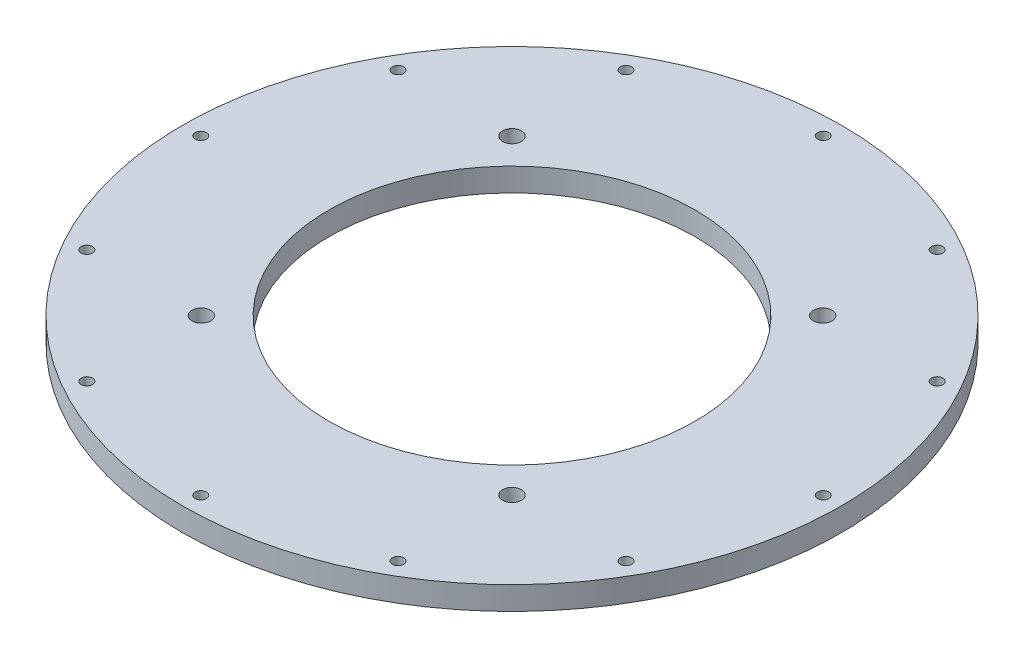
ISO-10303-21;
HEADER;
FILE_DESCRIPTION(('STEP AP214'),'2;1');
FILE_NAME('part.step','',(''),(''),'','','');
FILE_SCHEMA(('AUTOMOTIVE_DESIGN { 1 0 10303 214 1 1 1 1 }'));
ENDSEC;
DATA;
#1=APPLICATION_CONTEXT('core data for automotive mechanical design processes');
#2=APPLICATION_PROTOCOL_DEFINITION('international standard','automotive_design',2000,#1);
#3=PRODUCT_CONTEXT('',#1,'mechanical');
#4=PRODUCT('Part','Part','',(#3));
#5=PRODUCT_RELATED_PRODUCT_CATEGORY('part','',(#4));
#6=PRODUCT_DEFINITION_FORMATION('','',#4);
#7=PRODUCT_DEFINITION_CONTEXT('part definition',#1,'design');
#8=PRODUCT_DEFINITION('design','',#6,#7);
#9=PRODUCT_DEFINITION_SHAPE('','',#8);
#10=(LENGTH_UNIT() NAMED_UNIT(*) SI_UNIT(.MILLI.,.METRE.));
#11=(NAMED_UNIT(*) PLANE_ANGLE_UNIT() SI_UNIT($,.RADIAN.));
#12=(NAMED_UNIT(*) SI_UNIT($,.STERADIAN.) SOLID_ANGLE_UNIT());
#13=UNCERTAINTY_MEASURE_WITH_UNIT(LENGTH_MEASURE(1.E-05),#10,'distance_accuracy_value','');
#14=(GEOMETRIC_REPRESENTATION_CONTEXT(3) GLOBAL_UNCERTAINTY_ASSIGNED_CONTEXT((#13)) GLOBAL_UNIT_ASSIGNED_CONTEXT((#10,
#11,#12)) REPRESENTATION_CONTEXT('',''));
#15=CARTESIAN_POINT('',(0.,0.,0.));
#16=DIRECTION('',(0.,0.,1.));
#17=DIRECTION('',(1.,0.,0.));
#18=AXIS2_PLACEMENT_3D('',#15,#16,#17);
#19=CARTESIAN_POINT('',(78.55,0.,0.));
#20=DIRECTION('',(0.,0.,1.));
#21=DIRECTION('',(1.,0.,0.));
#22=AXIS2_PLACEMENT_3D('',#19,#20,#21);
#23=ELLIPSE('',#22,3.25,2.165);
#24=CARTESIAN_POINT('',(0.,0.,0.));
#25=DIRECTION('',(0.,-1.,0.));
#26=AXIS1_PLACEMENT('',#24,#25);
#27=SURFACE_OF_REVOLUTION('',#23,#26);
#28=CARTESIAN_POINT('',(0.,0.,0.));
#29=DIRECTION('',(0.,-1.,0.));
#30=DIRECTION('',(0.,0.,-1.));
#31=AXIS2_PLACEMENT_3D('',#28,#29,#30);
#32=CIRCLE('',#31,75.3);
#33=CARTESIAN_POINT('',(0.,0.,-75.3));
#34=VERTEX_POINT('',#33);
#35=EDGE_CURVE('E61',#34,#34,#32,.T.);
#36=ORIENTED_EDGE('',*,*,#35,.F.);
#37=EDGE_LOOP('',(#36));
#38=FACE_BOUND('',#37,.T.);
#39=CARTESIAN_POINT('',(0.,0.,0.));
#40=DIRECTION('',(0.,-1.,0.));
#41=DIRECTION('',(0.,0.,-1.));
#42=AXIS2_PLACEMENT_3D('',#39,#40,#41);
#43=CIRCLE('',#42,81.8);
#44=CARTESIAN_POINT('',(0.,0.,-81.8));
#45=VERTEX_POINT('',#44);
#46=EDGE_CURVE('E10',#45,#45,#43,.T.);
#47=ORIENTED_EDGE('',*,*,#46,.T.);
#48=EDGE_LOOP('',(#47));
#49=FACE_BOUND('',#48,.T.);
#50=ADVANCED_FACE('F38',(#38,#49),#27,.T.);
#51=CARTESIAN_POINT('',(0.,0.,0.));
#52=DIRECTION('',(0.,-1.,0.));
#53=DIRECTION('',(0.,0.,-1.));
#54=AXIS2_PLACEMENT_3D('',#51,#52,#53);
#55=PLANE('',#54);
#56=CARTESIAN_POINT('',(0.,0.,85.));
#57=DIRECTION('',(0.,-1.,0.));
#58=DIRECTION('',(0.,0.,-1.));
#59=AXIS2_PLACEMENT_3D('',#56,#57,#58);
#60=CIRCLE('',#59,1.55);
#61=CARTESIAN_POINT('',(0.,0.,83.45));
#62=VERTEX_POINT('',#61);
#63=EDGE_CURVE('E89',#62,#62,#60,.T.);
#64=ORIENTED_EDGE('',*,*,#63,.F.);
#65=EDGE_LOOP('',(#64));
#66=FACE_BOUND('',#65,.T.);
#67=CARTESIAN_POINT('',(-85.,0.,8.90327741404999E-13));
#68=DIRECTION('',(0.,-1.,0.));
#69=DIRECTION('',(0.,0.,-1.));
#70=AXIS2_PLACEMENT_3D('',#67,#68,#69);
#71=CIRCLE('',#70,1.55);
#72=CARTESIAN_POINT('',(-85.,0.,-1.54999999999911));
#73=VERTEX_POINT('',#72);
#74=EDGE_CURVE('E99',#73,#73,#71,.T.);
#75=ORIENTED_EDGE('',*,*,#74,.F.);
#76=EDGE_LOOP('',(#75));
#77=FACE_BOUND('',#76,.T.);
#78=CARTESIAN_POINT('',(-73.6121593216768,0.,42.5000000000009));
#79=DIRECTION('',(0.,-1.,0.));
#80=DIRECTION('',(0.,0.,-1.));
#81=AXIS2_PLACEMENT_3D('',#78,#79,#80);
#82=CIRCLE('',#81,1.54999999999999);
#83=CARTESIAN_POINT('',(-73.6121593216768,0.,40.9500000000009));
#84=VERTEX_POINT('',#83);
#85=EDGE_CURVE('E130',#84,#84,#82,.T.);
#86=ORIENTED_EDGE('',*,*,#85,.F.);
#87=EDGE_LOOP('',(#86));
#88=FACE_BOUND('',#87,.T.);
#89=CARTESIAN_POINT('',(-42.4999999999991,0.,73.6121593216778));
#90=DIRECTION('',(0.,-1.,0.));
#91=DIRECTION('',(0.,0.,-1.));
#92=AXIS2_PLACEMENT_3D('',#89,#90,#91);
#93=CIRCLE('',#92,1.54999999999999);
#94=CARTESIAN_POINT('',(-42.4999999999991,0.,72.0621593216778));
#95=VERTEX_POINT('',#94);
#96=EDGE_CURVE('E124',#95,#95,#93,.T.);
#97=ORIENTED_EDGE('',*,*,#96,.F.);
#98=EDGE_LOOP('',(#97));
#99=FACE_BOUND('',#98,.T.);
#100=CARTESIAN_POINT('',(42.5000000000001,0.,73.6121593216772));
#101=DIRECTION('',(0.,-1.,0.));
#102=DIRECTION('',(0.,0.,-1.));
#103=AXIS2_PLACEMENT_3D('',#100,#101,#102);
#104=CIRCLE('',#103,1.55);
#105=CARTESIAN_POINT('',(42.5000000000001,0.,72.0621593216772));
#106=VERTEX_POINT('',#105);
#107=EDGE_CURVE('E86',#106,#106,#104,.T.);
#108=ORIENTED_EDGE('',*,*,#107,.F.);
#109=EDGE_LOOP('',(#108));
#110=FACE_BOUND('',#109,.T.);
#111=CARTESIAN_POINT('',(73.6121593216774,0.,42.4999999999998));
#112=DIRECTION('',(0.,-1.,0.));
#113=DIRECTION('',(0.,0.,-1.));
#114=AXIS2_PLACEMENT_3D('',#111,#112,#113);
#115=CIRCLE('',#114,1.55);
#116=CARTESIAN_POINT('',(73.6121593216774,0.,40.9499999999998));
#117=VERTEX_POINT('',#116);
#118=EDGE_CURVE('E80',#117,#117,#115,.T.);
#119=ORIENTED_EDGE('',*,*,#118,.F.);
#120=EDGE_LOOP('',(#119));
#121=FACE_BOUND('',#120,.T.);
#122=CARTESIAN_POINT('',(85.,0.,-2.96775913801666E-13));
#123=DIRECTION('',(0.,-1.,0.));
#124=DIRECTION('',(0.,0.,-1.));
#125=AXIS2_PLACEMENT_3D('',#122,#123,#124);
#126=CIRCLE('',#125,1.55);
#127=CARTESIAN_POINT('',(85.,0.,-1.5500000000003));
#128=VERTEX_POINT('',#127);
#129=EDGE_CURVE('E74',#128,#128,#126,.T.);
#130=ORIENTED_EDGE('',*,*,#129,.F.);
#131=EDGE_LOOP('',(#130));
#132=FACE_BOUND('',#131,.T.);
#133=CARTESIAN_POINT('',(73.6121593216771,0.,-42.5000000000003));
#134=DIRECTION('',(0.,-1.,0.));
#135=DIRECTION('',(0.,0.,-1.));
#136=AXIS2_PLACEMENT_3D('',#133,#134,#135);
#137=CIRCLE('',#136,1.55000000000001);
#138=CARTESIAN_POINT('',(73.6121593216771,0.,-44.0500000000004));
#139=VERTEX_POINT('',#138);
#140=EDGE_CURVE('E66',#139,#139,#137,.T.);
#141=ORIENTED_EDGE('',*,*,#140,.F.);
#142=EDGE_LOOP('',(#141));
#143=FACE_BOUND('',#142,.T.);
#144=CARTESIAN_POINT('',(42.4999999999996,0.,-73.6121593216776));
#145=DIRECTION('',(0.,-1.,0.));
#146=DIRECTION('',(0.,0.,-1.));
#147=AXIS2_PLACEMENT_3D('',#144,#145,#146);
#148=CIRCLE('',#147,1.55);
#149=CARTESIAN_POINT('',(42.4999999999996,0.,-75.1621593216775));
#150=VERTEX_POINT('',#149);
#151=EDGE_CURVE('E73',#150,#150,#148,.T.);
#152=ORIENTED_EDGE('',*,*,#151,.F.);
#153=EDGE_LOOP('',(#152));
#154=FACE_BOUND('',#153,.T.);
#155=CARTESIAN_POINT('',(-5.93551827603333E-13,0.,-85.));
#156=DIRECTION('',(0.,-1.,0.));
#157=DIRECTION('',(0.,0.,-1.));
#158=AXIS2_PLACEMENT_3D('',#155,#156,#157);
#159=CIRCLE('',#158,1.55);
#160=CARTESIAN_POINT('',(-5.93551827603333E-13,0.,-86.55));
#161=VERTEX_POINT('',#160);
#162=EDGE_CURVE('E106',#161,#161,#159,.T.);
#163=ORIENTED_EDGE('',*,*,#162,.F.);
#164=EDGE_LOOP('',(#163));
#165=FACE_BOUND('',#164,.T.);
#166=CARTESIAN_POINT('',(-42.5000000000006,0.,-73.612159321677));
#167=DIRECTION('',(0.,-1.,0.));
#168=DIRECTION('',(0.,0.,-1.));
#169=AXIS2_PLACEMENT_3D('',#166,#167,#168);
#170=CIRCLE('',#169,1.55);
#171=CARTESIAN_POINT('',(-42.5000000000006,0.,-75.162159321677));
#172=VERTEX_POINT('',#171);
#173=EDGE_CURVE('E100',#172,#172,#170,.T.);
#174=ORIENTED_EDGE('',*,*,#173,.F.);
#175=EDGE_LOOP('',(#174));
#176=FACE_BOUND('',#175,.T.);
#177=CARTESIAN_POINT('',(-73.6121593216777,0.,-42.4999999999993));
#178=DIRECTION('',(0.,-1.,0.));
#179=DIRECTION('',(0.,0.,-1.));
#180=AXIS2_PLACEMENT_3D('',#177,#178,#179);
#181=CIRCLE('',#180,1.54999999999999);
#182=CARTESIAN_POINT('',(-73.6121593216777,0.,-44.0499999999993));
#183=VERTEX_POINT('',#182);
#184=EDGE_CURVE('E92',#183,#183,#181,.T.);
#185=ORIENTED_EDGE('',*,*,#184,.F.);
#186=EDGE_LOOP('',(#185));
#187=FACE_BOUND('',#186,.T.);
#188=CARTESIAN_POINT('',(0.,0.,0.));
#189=DIRECTION('',(0.,-1.,0.));
#190=DIRECTION('',(0.,0.,-1.));
#191=AXIS2_PLACEMENT_3D('',#188,#189,#190);
#192=CIRCLE('',#191,90.);
#193=CARTESIAN_POINT('',(0.,0.,-90.));
#194=VERTEX_POINT('',#193);
#195=EDGE_CURVE('E45',#194,#194,#192,.T.);
#196=ORIENTED_EDGE('',*,*,#195,.T.);
#197=EDGE_LOOP('',(#196));
#198=FACE_BOUND('',#197,.T.);
#199=ORIENTED_EDGE('',*,*,#46,.F.);
#200=EDGE_LOOP('',(#199));
#201=FACE_BOUND('',#200,.T.);
#202=ADVANCED_FACE('F164',(#66,#77,#88,#99,#110,#121,#132,#143,#154,#165,#176,#187,#198,#201),
#55,.T.);
#203=CARTESIAN_POINT('',(0.,0.,0.));
#204=DIRECTION('',(0.,-1.,0.));
#205=DIRECTION('',(0.,0.,-1.));
#206=AXIS2_PLACEMENT_3D('',#203,#204,#205);
#207=CYLINDRICAL_SURFACE('',#206,90.);
#208=ORIENTED_EDGE('',*,*,#195,.F.);
#209=EDGE_LOOP('',(#208));
#210=FACE_BOUND('',#209,.T.);
#211=CARTESIAN_POINT('',(0.,6.35,0.));
#212=DIRECTION('',(0.,-1.,0.));
#213=DIRECTION('',(0.,0.,-1.));
#214=AXIS2_PLACEMENT_3D('',#211,#212,#213);
#215=CIRCLE('',#214,90.);
#216=CARTESIAN_POINT('',(0.,6.35,-90.));
#217=VERTEX_POINT('',#216);
#218=EDGE_CURVE('E49',#217,#217,#215,.T.);
#219=ORIENTED_EDGE('',*,*,#218,.T.);
#220=EDGE_LOOP('',(#219));
#221=FACE_BOUND('',#220,.T.);
#222=ADVANCED_FACE('F167',(#210,#221),#207,.T.);
#223=CARTESIAN_POINT('',(0.,6.35,0.));
#224=DIRECTION('',(0.,-1.,0.));
#225=DIRECTION('',(0.,0.,-1.));
#226=AXIS2_PLACEMENT_3D('',#223,#224,#225);
#227=PLANE('',#226);
#228=CARTESIAN_POINT('',(0.,6.35,85.));
#229=DIRECTION('',(0.,-1.,0.));
#230=DIRECTION('',(0.,0.,-1.));
#231=AXIS2_PLACEMENT_3D('',#228,#229,#230);
#232=CIRCLE('',#231,1.55);
#233=CARTESIAN_POINT('',(0.,6.35,83.45));
#234=VERTEX_POINT('',#233);
#235=EDGE_CURVE('E63',#234,#234,#232,.F.);
#236=ORIENTED_EDGE('',*,*,#235,.F.);
#237=EDGE_LOOP('',(#236));
#238=FACE_BOUND('',#237,.T.);
#239=CARTESIAN_POINT('',(-85.,6.35,8.90327741404999E-13));
#240=DIRECTION('',(0.,-1.,0.));
#241=DIRECTION('',(0.,0.,-1.));
#242=AXIS2_PLACEMENT_3D('',#239,#240,#241);
#243=CIRCLE('',#242,1.55);
#244=CARTESIAN_POINT('',(-85.,6.35,-1.54999999999911));
#245=VERTEX_POINT('',#244);
#246=EDGE_CURVE('E133',#245,#245,#243,.F.);
#247=ORIENTED_EDGE('',*,*,#246,.F.);
#248=EDGE_LOOP('',(#247));
#249=FACE_BOUND('',#248,.T.);
#250=CARTESIAN_POINT('',(-73.6121593216768,6.35,42.5000000000009));
#251=DIRECTION('',(0.,-1.,0.));
#252=DIRECTION('',(0.,0.,-1.));
#253=AXIS2_PLACEMENT_3D('',#250,#251,#252);
#254=CIRCLE('',#253,1.54999999999999);
#255=CARTESIAN_POINT('',(-73.6121593216768,6.35,40.9500000000009));
#256=VERTEX_POINT('',#255);
#257=EDGE_CURVE('E127',#256,#256,#254,.F.);
#258=ORIENTED_EDGE('',*,*,#257,.F.);
#259=EDGE_LOOP('',(#258));
#260=FACE_BOUND('',#259,.T.);
#261=CARTESIAN_POINT('',(-42.4999999999991,6.35,73.6121593216778));
#262=DIRECTION('',(0.,-1.,0.));
#263=DIRECTION('',(0.,0.,-1.));
#264=AXIS2_PLACEMENT_3D('',#261,#262,#263);
#265=CIRCLE('',#264,1.54999999999999);
#266=CARTESIAN_POINT('',(-42.4999999999991,6.35,72.0621593216778));
#267=VERTEX_POINT('',#266);
#268=EDGE_CURVE('E119',#267,#267,#265,.F.);
#269=ORIENTED_EDGE('',*,*,#268,.F.);
#270=EDGE_LOOP('',(#269));
#271=FACE_BOUND('',#270,.T.);
#272=CARTESIAN_POINT('',(-42.4264068711928,6.35,42.4264068711929));
#273=DIRECTION('',(0.,-1.,0.));
#274=DIRECTION('',(0.,0.,-1.));
#275=AXIS2_PLACEMENT_3D('',#272,#273,#274);
#276=CIRCLE('',#275,2.55);
#277=CARTESIAN_POINT('',(-42.4264068711928,6.35,39.8764068711929));
#278=VERTEX_POINT('',#277);
#279=EDGE_CURVE('E120',#278,#278,#276,.F.);
#280=ORIENTED_EDGE('',*,*,#279,.F.);
#281=EDGE_LOOP('',(#280));
#282=FACE_BOUND('',#281,.T.);
#283=CARTESIAN_POINT('',(42.4264068711929,6.35,42.4264068711928));
#284=DIRECTION('',(0.,-1.,0.));
#285=DIRECTION('',(0.,0.,-1.));
#286=AXIS2_PLACEMENT_3D('',#283,#284,#285);
#287=CIRCLE('',#286,2.55000000000018);
#288=CARTESIAN_POINT('',(42.4264068711929,6.35,39.8764068711926));
#289=VERTEX_POINT('',#288);
#290=EDGE_CURVE('E150',#289,#289,#287,.F.);
#291=ORIENTED_EDGE('',*,*,#290,.F.);
#292=EDGE_LOOP('',(#291));
#293=FACE_BOUND('',#292,.T.);
#294=CARTESIAN_POINT('',(42.4264068711928,6.35,-42.4264068711929));
#295=DIRECTION('',(0.,-1.,0.));
#296=DIRECTION('',(0.,0.,-1.));
#297=AXIS2_PLACEMENT_3D('',#294,#295,#296);
#298=CIRCLE('',#297,2.55000000000038);
#299=CARTESIAN_POINT('',(42.4264068711928,6.35,-44.9764068711933));
#300=VERTEX_POINT('',#299);
#301=EDGE_CURVE('E143',#300,#300,#298,.F.);
#302=ORIENTED_EDGE('',*,*,#301,.F.);
#303=EDGE_LOOP('',(#302));
#304=FACE_BOUND('',#303,.T.);
#305=CARTESIAN_POINT('',(-42.4264068711929,6.35,-42.4264068711928));
#306=DIRECTION('',(0.,-1.,0.));
#307=DIRECTION('',(0.,0.,-1.));
#308=AXIS2_PLACEMENT_3D('',#305,#306,#307);
#309=CIRCLE('',#308,2.55000000000056);
#310=CARTESIAN_POINT('',(-42.4264068711929,6.35,-44.9764068711933));
#311=VERTEX_POINT('',#310);
#312=EDGE_CURVE('E144',#311,#311,#309,.F.);
#313=ORIENTED_EDGE('',*,*,#312,.F.);
#314=EDGE_LOOP('',(#313));
#315=FACE_BOUND('',#314,.T.);
#316=CARTESIAN_POINT('',(42.5000000000001,6.35,73.6121593216772));
#317=DIRECTION('',(0.,-1.,0.));
#318=DIRECTION('',(0.,0.,-1.));
#319=AXIS2_PLACEMENT_3D('',#316,#317,#318);
#320=CIRCLE('',#319,1.55);
#321=CARTESIAN_POINT('',(42.5000000000001,6.35,72.0621593216772));
#322=VERTEX_POINT('',#321);
#323=EDGE_CURVE('E83',#322,#322,#320,.F.);
#324=ORIENTED_EDGE('',*,*,#323,.F.);
#325=EDGE_LOOP('',(#324));
#326=FACE_BOUND('',#325,.T.);
#327=CARTESIAN_POINT('',(73.6121593216774,6.35,42.4999999999998));
#328=DIRECTION('',(0.,-1.,0.));
#329=DIRECTION('',(0.,0.,-1.));
#330=AXIS2_PLACEMENT_3D('',#327,#328,#329);
#331=CIRCLE('',#330,1.55);
#332=CARTESIAN_POINT('',(73.6121593216774,6.35,40.9499999999998));
#333=VERTEX_POINT('',#332);
#334=EDGE_CURVE('E77',#333,#333,#331,.F.);
#335=ORIENTED_EDGE('',*,*,#334,.F.);
#336=EDGE_LOOP('',(#335));
#337=FACE_BOUND('',#336,.T.);
#338=CARTESIAN_POINT('',(85.,6.35,-2.96775913801666E-13));
#339=DIRECTION('',(0.,-1.,0.));
#340=DIRECTION('',(0.,0.,-1.));
#341=AXIS2_PLACEMENT_3D('',#338,#339,#340);
#342=CIRCLE('',#341,1.55);
#343=CARTESIAN_POINT('',(85.,6.35,-1.5500000000003));
#344=VERTEX_POINT('',#343);
#345=EDGE_CURVE('E69',#344,#344,#342,.F.);
#346=ORIENTED_EDGE('',*,*,#345,.F.);
#347=EDGE_LOOP('',(#346));
#348=FACE_BOUND('',#347,.T.);
#349=CARTESIAN_POINT('',(73.6121593216771,6.35,-42.5000000000003));
#350=DIRECTION('',(0.,-1.,0.));
#351=DIRECTION('',(0.,0.,-1.));
#352=AXIS2_PLACEMENT_3D('',#349,#350,#351);
#353=CIRCLE('',#352,1.55000000000001);
#354=CARTESIAN_POINT('',(73.6121593216771,6.35,-44.0500000000004));
#355=VERTEX_POINT('',#354);
#356=EDGE_CURVE('E70',#355,#355,#353,.F.);
#357=ORIENTED_EDGE('',*,*,#356,.F.);
#358=EDGE_LOOP('',(#357));
#359=FACE_BOUND('',#358,.T.);
#360=CARTESIAN_POINT('',(42.4999999999996,6.35,-73.6121593216776));
#361=DIRECTION('',(0.,-1.,0.));
#362=DIRECTION('',(0.,0.,-1.));
#363=AXIS2_PLACEMENT_3D('',#360,#361,#362);
#364=CIRCLE('',#363,1.55);
#365=CARTESIAN_POINT('',(42.4999999999996,6.35,-75.1621593216775));
#366=VERTEX_POINT('',#365);
#367=EDGE_CURVE('E109',#366,#366,#364,.F.);
#368=ORIENTED_EDGE('',*,*,#367,.F.);
#369=EDGE_LOOP('',(#368));
#370=FACE_BOUND('',#369,.T.);
#371=CARTESIAN_POINT('',(-5.93551827603333E-13,6.35,-85.));
#372=DIRECTION('',(0.,-1.,0.));
#373=DIRECTION('',(0.,0.,-1.));
#374=AXIS2_PLACEMENT_3D('',#371,#372,#373);
#375=CIRCLE('',#374,1.55);
#376=CARTESIAN_POINT('',(-5.93551827603333E-13,6.35,-86.55));
#377=VERTEX_POINT('',#376);
#378=EDGE_CURVE('E103',#377,#377,#375,.F.);
#379=ORIENTED_EDGE('',*,*,#378,.F.);
#380=EDGE_LOOP('',(#379));
#381=FACE_BOUND('',#380,.T.);
#382=CARTESIAN_POINT('',(-42.5000000000006,6.35,-73.612159321677));
#383=DIRECTION('',(0.,-1.,0.));
#384=DIRECTION('',(0.,0.,-1.));
#385=AXIS2_PLACEMENT_3D('',#382,#383,#384);
#386=CIRCLE('',#385,1.55);
#387=CARTESIAN_POINT('',(-42.5000000000006,6.35,-75.162159321677));
#388=VERTEX_POINT('',#387);
#389=EDGE_CURVE('E95',#388,#388,#386,.F.);
#390=ORIENTED_EDGE('',*,*,#389,.F.);
#391=EDGE_LOOP('',(#390));
#392=FACE_BOUND('',#391,.T.);
#393=CARTESIAN_POINT('',(-73.6121593216777,6.35,-42.4999999999993));
#394=DIRECTION('',(0.,-1.,0.));
#395=DIRECTION('',(0.,0.,-1.));
#396=AXIS2_PLACEMENT_3D('',#393,#394,#395);
#397=CIRCLE('',#396,1.54999999999999);
#398=CARTESIAN_POINT('',(-73.6121593216777,6.35,-44.0499999999993));
#399=VERTEX_POINT('',#398);
#400=EDGE_CURVE('E96',#399,#399,#397,.F.);
#401=ORIENTED_EDGE('',*,*,#400,.F.);
#402=EDGE_LOOP('',(#401));
#403=FACE_BOUND('',#402,.T.);
#404=ORIENTED_EDGE('',*,*,#218,.F.);
#405=EDGE_LOOP('',(#404));
#406=FACE_BOUND('',#405,.T.);
#407=CARTESIAN_POINT('',(0.,6.35,0.));
#408=DIRECTION('',(0.,-1.,0.));
#409=DIRECTION('',(0.,0.,-1.));
#410=AXIS2_PLACEMENT_3D('',#407,#408,#409);
#411=CIRCLE('',#410,50.);
#412=CARTESIAN_POINT('',(0.,6.35,-50.));
#413=VERTEX_POINT('',#412);
#414=EDGE_CURVE('E53',#413,#413,#411,.T.);
#415=ORIENTED_EDGE('',*,*,#414,.T.);
#416=EDGE_LOOP('',(#415));
#417=FACE_BOUND('',#416,.T.);
#418=ADVANCED_FACE('F226',(#238,#249,#260,#271,#282,#293,#304,#315,#326,#337,#348,#359,#370,
#381,#392,#403,#406,#417),#227,.F.);
#419=CARTESIAN_POINT('',(0.,0.,0.));
#420=DIRECTION('',(0.,-1.,0.));
#421=DIRECTION('',(0.,0.,-1.));
#422=AXIS2_PLACEMENT_3D('',#419,#420,#421);
#423=CYLINDRICAL_SURFACE('',#422,50.);
#424=CARTESIAN_POINT('',(0.,0.,0.));
#425=DIRECTION('',(0.,-1.,0.));
#426=DIRECTION('',(0.,0.,-1.));
#427=AXIS2_PLACEMENT_3D('',#424,#425,#426);
#428=CIRCLE('',#427,50.);
#429=CARTESIAN_POINT('',(0.,0.,-50.));
#430=VERTEX_POINT('',#429);
#431=EDGE_CURVE('E58',#430,#430,#428,.T.);
#432=ORIENTED_EDGE('',*,*,#431,.T.);
#433=EDGE_LOOP('',(#432));
#434=FACE_BOUND('',#433,.T.);
#435=ORIENTED_EDGE('',*,*,#414,.F.);
#436=EDGE_LOOP('',(#435));
#437=FACE_BOUND('',#436,.T.);
#438=ADVANCED_FACE('F220',(#434,#437),#423,.F.);
#439=CARTESIAN_POINT('',(-42.4264068711928,0.,42.4264068711929));
#440=DIRECTION('',(0.,-1.,0.));
#441=DIRECTION('',(0.,0.,-1.));
#442=AXIS2_PLACEMENT_3D('',#439,#440,#441);
#443=CIRCLE('',#442,2.55);
#444=CARTESIAN_POINT('',(-42.4264068711928,0.,39.8764068711929));
#445=VERTEX_POINT('',#444);
#446=EDGE_CURVE('E116',#445,#445,#443,.T.);
#447=ORIENTED_EDGE('',*,*,#446,.F.);
#448=EDGE_LOOP('',(#447));
#449=FACE_BOUND('',#448,.T.);
#450=CARTESIAN_POINT('',(42.4264068711929,0.,42.4264068711928));
#451=DIRECTION('',(0.,-1.,0.));
#452=DIRECTION('',(0.,0.,-1.));
#453=AXIS2_PLACEMENT_3D('',#450,#451,#452);
#454=CIRCLE('',#453,2.55000000000018);
#455=CARTESIAN_POINT('',(42.4264068711929,0.,39.8764068711926));
#456=VERTEX_POINT('',#455);
#457=EDGE_CURVE('E123',#456,#456,#454,.T.);
#458=ORIENTED_EDGE('',*,*,#457,.F.);
#459=EDGE_LOOP('',(#458));
#460=FACE_BOUND('',#459,.T.);
#461=CARTESIAN_POINT('',(42.4264068711928,0.,-42.4264068711929));
#462=DIRECTION('',(0.,-1.,0.));
#463=DIRECTION('',(0.,0.,-1.));
#464=AXIS2_PLACEMENT_3D('',#461,#462,#463);
#465=CIRCLE('',#464,2.55000000000038);
#466=CARTESIAN_POINT('',(42.4264068711928,0.,-44.9764068711933));
#467=VERTEX_POINT('',#466);
#468=EDGE_CURVE('E147',#467,#467,#465,.T.);
#469=ORIENTED_EDGE('',*,*,#468,.F.);
#470=EDGE_LOOP('',(#469));
#471=FACE_BOUND('',#470,.T.);
#472=CARTESIAN_POINT('',(-42.4264068711929,0.,-42.4264068711928));
#473=DIRECTION('',(0.,-1.,0.));
#474=DIRECTION('',(0.,0.,-1.));
#475=AXIS2_PLACEMENT_3D('',#472,#473,#474);
#476=CIRCLE('',#475,2.55000000000056);
#477=CARTESIAN_POINT('',(-42.4264068711929,0.,-44.9764068711933));
#478=VERTEX_POINT('',#477);
#479=EDGE_CURVE('E140',#478,#478,#476,.T.);
#480=ORIENTED_EDGE('',*,*,#479,.F.);
#481=EDGE_LOOP('',(#480));
#482=FACE_BOUND('',#481,.T.);
#483=ORIENTED_EDGE('',*,*,#35,.T.);
#484=EDGE_LOOP('',(#483));
#485=FACE_BOUND('',#484,.T.);
#486=ORIENTED_EDGE('',*,*,#431,.F.);
#487=EDGE_LOOP('',(#486));
#488=FACE_BOUND('',#487,.T.);
#489=ADVANCED_FACE('F169',(#449,#460,#471,#482,#485,#488),#55,.T.);
#490=CARTESIAN_POINT('',(-42.4264068711929,13.5624891681044,-42.4264068711928));
#491=DIRECTION('',(0.,-1.,0.));
#492=DIRECTION('',(0.,0.,-1.));
#493=AXIS2_PLACEMENT_3D('',#490,#491,#492);
#494=CYLINDRICAL_SURFACE('',#493,2.55000000000056);
#495=ORIENTED_EDGE('',*,*,#312,.T.);
#496=EDGE_LOOP('',(#495));
#497=FACE_BOUND('',#496,.T.);
#498=ORIENTED_EDGE('',*,*,#479,.T.);
#499=EDGE_LOOP('',(#498));
#500=FACE_BOUND('',#499,.T.);
#501=ADVANCED_FACE('F219',(#497,#500),#494,.F.);
#502=CARTESIAN_POINT('',(42.4264068711928,13.5624891681044,-42.4264068711929));
#503=DIRECTION('',(0.,-1.,0.));
#504=DIRECTION('',(0.,0.,-1.));
#505=AXIS2_PLACEMENT_3D('',#502,#503,#504);
#506=CYLINDRICAL_SURFACE('',#505,2.55000000000038);
#507=ORIENTED_EDGE('',*,*,#301,.T.);
#508=EDGE_LOOP('',(#507));
#509=FACE_BOUND('',#508,.T.);
#510=ORIENTED_EDGE('',*,*,#468,.T.);
#511=EDGE_LOOP('',(#510));
#512=FACE_BOUND('',#511,.T.);
#513=ADVANCED_FACE('F301',(#509,#512),#506,.F.);
#514=CARTESIAN_POINT('',(42.4264068711929,13.5624891681044,42.4264068711928));
#515=DIRECTION('',(0.,-1.,0.));
#516=DIRECTION('',(0.,0.,-1.));
#517=AXIS2_PLACEMENT_3D('',#514,#515,#516);
#518=CYLINDRICAL_SURFACE('',#517,2.55000000000018);
#519=ORIENTED_EDGE('',*,*,#290,.T.);
#520=EDGE_LOOP('',(#519));
#521=FACE_BOUND('',#520,.T.);
#522=ORIENTED_EDGE('',*,*,#457,.T.);
#523=EDGE_LOOP('',(#522));
#524=FACE_BOUND('',#523,.T.);
#525=ADVANCED_FACE('F206',(#521,#524),#518,.F.);
#526=CARTESIAN_POINT('',(-42.4264068711928,13.5624891681044,42.4264068711929));
#527=DIRECTION('',(0.,-1.,0.));
#528=DIRECTION('',(0.,0.,-1.));
#529=AXIS2_PLACEMENT_3D('',#526,#527,#528);
#530=CYLINDRICAL_SURFACE('',#529,2.55);
#531=ORIENTED_EDGE('',*,*,#279,.T.);
#532=EDGE_LOOP('',(#531));
#533=FACE_BOUND('',#532,.T.);
#534=ORIENTED_EDGE('',*,*,#446,.T.);
#535=EDGE_LOOP('',(#534));
#536=FACE_BOUND('',#535,.T.);
#537=ADVANCED_FACE('F196',(#533,#536),#530,.F.);
#538=CARTESIAN_POINT('',(-73.6121593216777,13.5624891681044,-42.4999999999993));
#539=DIRECTION('',(0.,-1.,0.));
#540=DIRECTION('',(0.,0.,-1.));
#541=AXIS2_PLACEMENT_3D('',#538,#539,#540);
#542=CYLINDRICAL_SURFACE('',#541,1.54999999999999);
#543=ORIENTED_EDGE('',*,*,#400,.T.);
#544=EDGE_LOOP('',(#543));
#545=FACE_BOUND('',#544,.T.);
#546=ORIENTED_EDGE('',*,*,#184,.T.);
#547=EDGE_LOOP('',(#546));
#548=FACE_BOUND('',#547,.T.);
#549=ADVANCED_FACE('F193',(#545,#548),#542,.F.);
#550=CARTESIAN_POINT('',(-42.5000000000006,13.5624891681044,-73.612159321677));
#551=DIRECTION('',(0.,-1.,0.));
#552=DIRECTION('',(0.,0.,-1.));
#553=AXIS2_PLACEMENT_3D('',#550,#551,#552);
#554=CYLINDRICAL_SURFACE('',#553,1.55);
#555=ORIENTED_EDGE('',*,*,#389,.T.);
#556=EDGE_LOOP('',(#555));
#557=FACE_BOUND('',#556,.T.);
#558=ORIENTED_EDGE('',*,*,#173,.T.);
#559=EDGE_LOOP('',(#558));
#560=FACE_BOUND('',#559,.T.);
#561=ADVANCED_FACE('F195',(#557,#560),#554,.F.);
#562=CARTESIAN_POINT('',(-5.93551827603333E-13,13.5624891681044,-85.));
#563=DIRECTION('',(0.,-1.,0.));
#564=DIRECTION('',(0.,0.,-1.));
#565=AXIS2_PLACEMENT_3D('',#562,#563,#564);
#566=CYLINDRICAL_SURFACE('',#565,1.55);
#567=ORIENTED_EDGE('',*,*,#378,.T.);
#568=EDGE_LOOP('',(#567));
#569=FACE_BOUND('',#568,.T.);
#570=ORIENTED_EDGE('',*,*,#162,.T.);
#571=EDGE_LOOP('',(#570));
#572=FACE_BOUND('',#571,.T.);
#573=ADVANCED_FACE('F203',(#569,#572),#566,.F.);
#574=CARTESIAN_POINT('',(42.4999999999996,13.5624891681044,-73.6121593216776));
#575=DIRECTION('',(0.,-1.,0.));
#576=DIRECTION('',(0.,0.,-1.));
#577=AXIS2_PLACEMENT_3D('',#574,#575,#576);
#578=CYLINDRICAL_SURFACE('',#577,1.55);
#579=ORIENTED_EDGE('',*,*,#367,.T.);
#580=EDGE_LOOP('',(#579));
#581=FACE_BOUND('',#580,.T.);
#582=ORIENTED_EDGE('',*,*,#151,.T.);
#583=EDGE_LOOP('',(#582));
#584=FACE_BOUND('',#583,.T.);
#585=ADVANCED_FACE('F243',(#581,#584),#578,.F.);
#586=CARTESIAN_POINT('',(73.6121593216771,13.5624891681044,-42.5000000000003));
#587=DIRECTION('',(0.,-1.,0.));
#588=DIRECTION('',(0.,0.,-1.));
#589=AXIS2_PLACEMENT_3D('',#586,#587,#588);
#590=CYLINDRICAL_SURFACE('',#589,1.55000000000001);
#591=ORIENTED_EDGE('',*,*,#356,.T.);
#592=EDGE_LOOP('',(#591));
#593=FACE_BOUND('',#592,.T.);
#594=ORIENTED_EDGE('',*,*,#140,.T.);
#595=EDGE_LOOP('',(#594));
#596=FACE_BOUND('',#595,.T.);
#597=ADVANCED_FACE('F239',(#593,#596),#590,.F.);
#598=CARTESIAN_POINT('',(85.,13.5624891681044,-2.96775913801666E-13));
#599=DIRECTION('',(0.,-1.,0.));
#600=DIRECTION('',(0.,0.,-1.));
#601=AXIS2_PLACEMENT_3D('',#598,#599,#600);
#602=CYLINDRICAL_SURFACE('',#601,1.55);
#603=ORIENTED_EDGE('',*,*,#345,.T.);
#604=EDGE_LOOP('',(#603));
#605=FACE_BOUND('',#604,.T.);
#606=ORIENTED_EDGE('',*,*,#129,.T.);
#607=EDGE_LOOP('',(#606));
#608=FACE_BOUND('',#607,.T.);
#609=ADVANCED_FACE('F242',(#605,#608),#602,.F.);
#610=CARTESIAN_POINT('',(73.6121593216774,13.5624891681044,42.4999999999998));
#611=DIRECTION('',(0.,-1.,0.));
#612=DIRECTION('',(0.,0.,-1.));
#613=AXIS2_PLACEMENT_3D('',#610,#611,#612);
#614=CYLINDRICAL_SURFACE('',#613,1.55);
#615=ORIENTED_EDGE('',*,*,#334,.T.);
#616=EDGE_LOOP('',(#615));
#617=FACE_BOUND('',#616,.T.);
#618=ORIENTED_EDGE('',*,*,#118,.T.);
#619=EDGE_LOOP('',(#618));
#620=FACE_BOUND('',#619,.T.);
#621=ADVANCED_FACE('F247',(#617,#620),#614,.F.);
#622=CARTESIAN_POINT('',(42.5000000000001,13.5624891681044,73.6121593216772));
#623=DIRECTION('',(0.,-1.,0.));
#624=DIRECTION('',(0.,0.,-1.));
#625=AXIS2_PLACEMENT_3D('',#622,#623,#624);
#626=CYLINDRICAL_SURFACE('',#625,1.55);
#627=ORIENTED_EDGE('',*,*,#323,.T.);
#628=EDGE_LOOP('',(#627));
#629=FACE_BOUND('',#628,.T.);
#630=ORIENTED_EDGE('',*,*,#107,.T.);
#631=EDGE_LOOP('',(#630));
#632=FACE_BOUND('',#631,.T.);
#633=ADVANCED_FACE('F250',(#629,#632),#626,.F.);
#634=CARTESIAN_POINT('',(-42.4999999999991,13.5624891681044,73.6121593216778));
#635=DIRECTION('',(0.,-1.,0.));
#636=DIRECTION('',(0.,0.,-1.));
#637=AXIS2_PLACEMENT_3D('',#634,#635,#636);
#638=CYLINDRICAL_SURFACE('',#637,1.54999999999999);
#639=ORIENTED_EDGE('',*,*,#268,.T.);
#640=EDGE_LOOP('',(#639));
#641=FACE_BOUND('',#640,.T.);
#642=ORIENTED_EDGE('',*,*,#96,.T.);
#643=EDGE_LOOP('',(#642));
#644=FACE_BOUND('',#643,.T.);
#645=ADVANCED_FACE('F253',(#641,#644),#638,.F.);
#646=CARTESIAN_POINT('',(-73.6121593216768,13.5624891681044,42.5000000000009));
#647=DIRECTION('',(0.,-1.,0.));
#648=DIRECTION('',(0.,0.,-1.));
#649=AXIS2_PLACEMENT_3D('',#646,#647,#648);
#650=CYLINDRICAL_SURFACE('',#649,1.54999999999999);
#651=ORIENTED_EDGE('',*,*,#257,.T.);
#652=EDGE_LOOP('',(#651));
#653=FACE_BOUND('',#652,.T.);
#654=ORIENTED_EDGE('',*,*,#85,.T.);
#655=EDGE_LOOP('',(#654));
#656=FACE_BOUND('',#655,.T.);
#657=ADVANCED_FACE('F258',(#653,#656),#650,.F.);
#658=CARTESIAN_POINT('',(-85.,13.5624891681044,8.90327741404999E-13));
#659=DIRECTION('',(0.,-1.,0.));
#660=DIRECTION('',(0.,0.,-1.));
#661=AXIS2_PLACEMENT_3D('',#658,#659,#660);
#662=CYLINDRICAL_SURFACE('',#661,1.55);
#663=ORIENTED_EDGE('',*,*,#246,.T.);
#664=EDGE_LOOP('',(#663));
#665=FACE_BOUND('',#664,.T.);
#666=ORIENTED_EDGE('',*,*,#74,.T.);
#667=EDGE_LOOP('',(#666));
#668=FACE_BOUND('',#667,.T.);
#669=ADVANCED_FACE('F294',(#665,#668),#662,.F.);
#670=CARTESIAN_POINT('',(0.,13.5624891681044,85.));
#671=DIRECTION('',(0.,-1.,0.));
#672=DIRECTION('',(0.,0.,-1.));
#673=AXIS2_PLACEMENT_3D('',#670,#671,#672);
#674=CYLINDRICAL_SURFACE('',#673,1.55);
#675=ORIENTED_EDGE('',*,*,#235,.T.);
#676=EDGE_LOOP('',(#675));
#677=FACE_BOUND('',#676,.T.);
#678=ORIENTED_EDGE('',*,*,#63,.T.);
#679=EDGE_LOOP('',(#678));
#680=FACE_BOUND('',#679,.T.);
#681=ADVANCED_FACE('F162',(#677,#680),#674,.F.);
#682=CLOSED_SHELL('',(#50,#202,#222,#418,#438,#489,#501,#513,#525,#537,#549,#561,#573,#585,#597,
#609,#621,#633,#645,#657,#669,#681));
#683=MANIFOLD_SOLID_BREP('B2',#682);
#684=ADVANCED_BREP_SHAPE_REPRESENTATION('',(#18,#683),#14);
#685=SHAPE_DEFINITION_REPRESENTATION(#9,#684);
ENDSEC;
END-ISO-10303-21;
